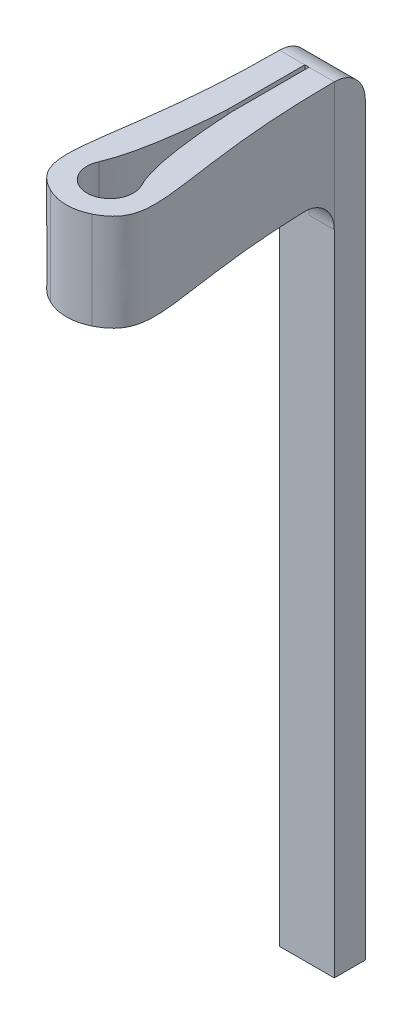
ISO-10303-21;
HEADER;
FILE_DESCRIPTION(('STEP AP214'),'2;1');
FILE_NAME('part.step','',(''),(''),'','','');
FILE_SCHEMA(('AUTOMOTIVE_DESIGN { 1 0 10303 214 1 1 1 1 }'));
ENDSEC;
DATA;
#1=APPLICATION_CONTEXT('core data for automotive mechanical design processes');
#2=APPLICATION_PROTOCOL_DEFINITION('international standard','automotive_design',2000,#1);
#3=PRODUCT_CONTEXT('',#1,'mechanical');
#4=PRODUCT('Part','Part','',(#3));
#5=PRODUCT_RELATED_PRODUCT_CATEGORY('part','',(#4));
#6=PRODUCT_DEFINITION_FORMATION('','',#4);
#7=PRODUCT_DEFINITION_CONTEXT('part definition',#1,'design');
#8=PRODUCT_DEFINITION('design','',#6,#7);
#9=PRODUCT_DEFINITION_SHAPE('','',#8);
#10=(LENGTH_UNIT() NAMED_UNIT(*) SI_UNIT(.MILLI.,.METRE.));
#11=(NAMED_UNIT(*) PLANE_ANGLE_UNIT() SI_UNIT($,.RADIAN.));
#12=(NAMED_UNIT(*) SI_UNIT($,.STERADIAN.) SOLID_ANGLE_UNIT());
#13=UNCERTAINTY_MEASURE_WITH_UNIT(LENGTH_MEASURE(1.E-05),#10,'distance_accuracy_value','');
#14=(GEOMETRIC_REPRESENTATION_CONTEXT(3) GLOBAL_UNCERTAINTY_ASSIGNED_CONTEXT((#13)) GLOBAL_UNIT_ASSIGNED_CONTEXT((#10,
#11,#12)) REPRESENTATION_CONTEXT('',''));
#15=CARTESIAN_POINT('',(0.,0.,0.));
#16=DIRECTION('',(0.,0.,1.));
#17=DIRECTION('',(1.,0.,0.));
#18=AXIS2_PLACEMENT_3D('',#15,#16,#17);
#19=CARTESIAN_POINT('',(0.895808533337032,-1.5875,-8.72399360067777));
#20=CARTESIAN_POINT('',(0.895808533337031,-1.5875,-4.54222595975247));
#21=CARTESIAN_POINT('',(1.58866877369205,-1.5875,-2.21931302735155));
#22=CARTESIAN_POINT('',(2.08819617284586,-1.5875,-1.33769603441971));
#23=CARTESIAN_POINT('',(0.,-1.5875,-0.766240153873851));
#24=B_SPLINE_CURVE_WITH_KNOTS('',4,(#19,#20,#21,#22,#23),.UNSPECIFIED.,.F.,.F.,(5,5),(0.,1.),.UNSPECIFIED.);
#25=DIRECTION('',(0.,1.,0.));
#26=VECTOR('',#25,1.);
#27=SURFACE_OF_LINEAR_EXTRUSION('',#24,#26);
#28=CARTESIAN_POINT('',(0.895808533337032,1.5875,-8.72399360067777));
#29=CARTESIAN_POINT('',(0.895808533337031,1.5875,-4.54222595975247));
#30=CARTESIAN_POINT('',(1.58866877369205,1.5875,-2.21931302735155));
#31=CARTESIAN_POINT('',(2.08819617284586,1.5875,-1.33769603441971));
#32=CARTESIAN_POINT('',(0.,1.5875,-0.766240153873851));
#33=B_SPLINE_CURVE_WITH_KNOTS('',4,(#28,#29,#30,#31,#32),.UNSPECIFIED.,.F.,.F.,(5,5),(0.,1.),.UNSPECIFIED.);
#34=CARTESIAN_POINT('',(0.895808533337032,1.5875,-8.72399360067777));
#35=VERTEX_POINT('',#34);
#36=CARTESIAN_POINT('',(0.681157625975045,1.5875,-1.01372499642951));
#37=VERTEX_POINT('',#36);
#38=EDGE_CURVE('E200',#35,#37,#33,.T.);
#39=ORIENTED_EDGE('',*,*,#38,.T.);
#40=DIRECTION('',(0.,1.,0.));
#41=VECTOR('',#40,1.);
#42=CARTESIAN_POINT('',(0.681157625975055,1.5875,-1.01372499642951));
#43=LINE('',#42,#41);
#44=CARTESIAN_POINT('',(0.681157625975045,-1.5875,-1.01372499642951));
#45=VERTEX_POINT('',#44);
#46=EDGE_CURVE('E335',#37,#45,#43,.F.);
#47=ORIENTED_EDGE('',*,*,#46,.T.);
#48=CARTESIAN_POINT('',(0.911587539087842,-1.5875,-7.70799360067432));
#49=VERTEX_POINT('',#48);
#50=EDGE_CURVE('E238',#49,#45,#24,.T.);
#51=ORIENTED_EDGE('',*,*,#50,.F.);
#52=CARTESIAN_POINT('',(0.911587539197454,-1.5875,-7.70799360067777));
#53=CARTESIAN_POINT('',(0.910687809800488,-1.58750020154353,-7.73656228207012));
#54=CARTESIAN_POINT('',(0.909828401695823,-1.58870574045511,-7.7651185656679));
#55=CARTESIAN_POINT('',(0.90819300425027,-1.5935157615637,-7.82202947828193));
#56=CARTESIAN_POINT('',(0.907417011268845,-1.59712013901737,-7.85038411604825));
#57=CARTESIAN_POINT('',(0.90522061742666,-1.61149830750074,-7.934791382646));
#58=CARTESIAN_POINT('',(0.903928824259647,-1.62583722506948,-7.99028250102405));
#59=CARTESIAN_POINT('',(0.901687780355163,-1.66362767079934,-8.09807597420566));
#60=CARTESIAN_POINT('',(0.900738699721182,-1.6870837122351,-8.1503767348191));
#61=CARTESIAN_POINT('',(0.899148918125929,-1.7424439920314,-8.25030140229158));
#62=CARTESIAN_POINT('',(0.898508161508523,-1.77434670405493,-8.29792615198959));
#63=CARTESIAN_POINT('',(0.897480241404394,-1.84568248092687,-8.38713458214714));
#64=CARTESIAN_POINT('',(0.897093041736971,-1.88511447036556,-8.42871912384035));
#65=CARTESIAN_POINT('',(0.896505635566173,-1.97042533950588,-8.50469331607981));
#66=CARTESIAN_POINT('',(0.896305426265007,-2.01630412273733,-8.53908307427001));
#67=CARTESIAN_POINT('',(0.896095275332461,-2.08893141968298,-8.58451809079835));
#68=CARTESIAN_POINT('',(0.896040243582188,-2.11379891917112,-8.5986478706947));
#69=CARTESIAN_POINT('',(0.895952741355683,-2.16461033576607,-8.62475273887168));
#70=CARTESIAN_POINT('',(0.895920250848357,-2.19055327540558,-8.63672973317594));
#71=CARTESIAN_POINT('',(0.895845880076851,-2.26975528018769,-8.66930535432631));
#72=CARTESIAN_POINT('',(0.895826986363067,-2.32443795537599,-8.68658010362134));
#73=CARTESIAN_POINT('',(0.89581162290249,-2.41678549274286,-8.7073988816611));
#74=CARTESIAN_POINT('',(0.895809696419543,-2.45387963513848,-8.71361781330608));
#75=CARTESIAN_POINT('',(0.895808522239813,-2.52847501112442,-8.72191351181843));
#76=CARTESIAN_POINT('',(0.895809270752433,-2.56597559364876,-8.72399613352736));
#77=CARTESIAN_POINT('',(0.895808533337032,-2.6035,-8.72399360067777));
#78=B_SPLINE_CURVE_WITH_KNOTS('',3,(#52,#53,#54,#55,#56,#57,#58,#59,#60,#61,#62,#63,#64,#65,#66,
#67,#68,#69,#70,#71,#72,#73,#74,#75,#76,#77),.UNSPECIFIED.,.F.,.F.,(4,2,2,2,2,2,2,2,2,2,2,2,4),
(0.,0.085695932904716,0.171388124211498,0.342490591302074,0.513677867809693,0.684834231385102,
0.855966166890245,1.02709554184067,1.1128111033343,1.19845039648162,1.36955284386112,
1.48218102751132,1.5946496748889),.UNSPECIFIED.);
#79=CARTESIAN_POINT('',(0.895808533337032,-2.6035,-8.72399360067777));
#80=VERTEX_POINT('',#79);
#81=EDGE_CURVE('E384',#49,#80,#78,.T.);
#82=ORIENTED_EDGE('',*,*,#81,.T.);
#83=DIRECTION('',(0.,1.,0.));
#84=VECTOR('',#83,1.);
#85=CARTESIAN_POINT('',(0.895808533337032,-1.5875,-8.72399360067777));
#86=LINE('',#85,#84);
#87=EDGE_CURVE('E74',#80,#35,#86,.T.);
#88=ORIENTED_EDGE('',*,*,#87,.T.);
#89=EDGE_LOOP('',(#39,#47,#51,#82,#88));
#90=FACE_BOUND('',#89,.T.);
#91=ADVANCED_FACE('F53',(#90),#27,.F.);
#92=CARTESIAN_POINT('',(-0.895808533337031,-1.5875,-8.72399360067777));
#93=CARTESIAN_POINT('',(-0.895808533337032,-1.5875,-4.54222595975247));
#94=CARTESIAN_POINT('',(-1.58866877369205,-1.5875,-2.21931302735155));
#95=CARTESIAN_POINT('',(-2.08819617284586,-1.5875,-1.33769603441971));
#96=CARTESIAN_POINT('',(0.,-1.5875,-0.766240153873851));
#97=B_SPLINE_CURVE_WITH_KNOTS('',4,(#92,#93,#94,#95,#96),.UNSPECIFIED.,.F.,.F.,(5,5),(0.,1.),.UNSPECIFIED.);
#98=DIRECTION('',(0.,1.,0.));
#99=VECTOR('',#98,1.);
#100=SURFACE_OF_LINEAR_EXTRUSION('',#97,#99);
#101=DIRECTION('',(0.,1.,0.));
#102=VECTOR('',#101,1.);
#103=CARTESIAN_POINT('',(-0.895808533337031,-1.5875,-8.72399360067777));
#104=LINE('',#103,#102);
#105=CARTESIAN_POINT('',(-0.895808533337031,-2.6035,-8.72399360067777));
#106=VERTEX_POINT('',#105);
#107=CARTESIAN_POINT('',(-0.895808533337031,1.5875,-8.72399360067777));
#108=VERTEX_POINT('',#107);
#109=EDGE_CURVE('E358',#106,#108,#104,.T.);
#110=ORIENTED_EDGE('',*,*,#109,.F.);
#111=CARTESIAN_POINT('',(-0.895808533337031,-2.6035,-8.72399360067777));
#112=CARTESIAN_POINT('',(-0.895808743106817,-2.57491535799627,-8.72399339704989));
#113=CARTESIAN_POINT('',(-0.895808509634764,-2.54634442105056,-8.72278651625416));
#114=CARTESIAN_POINT('',(-0.895808945285132,-2.48940695736893,-8.71797176093347));
#115=CARTESIAN_POINT('',(-0.895809614365375,-2.46104042114313,-8.71436399861163));
#116=CARTESIAN_POINT('',(-0.895815652000113,-2.37660177242559,-8.69997359110934));
#117=CARTESIAN_POINT('',(-0.895825039858982,-2.32109522362829,-8.68562373061271));
#118=CARTESIAN_POINT('',(-0.895889673653902,-2.21328087570048,-8.64780997418841));
#119=CARTESIAN_POINT('',(-0.89594494164699,-2.16097462811514,-8.6243416974372));
#120=CARTESIAN_POINT('',(-0.896155773215785,-2.06104521858159,-8.56895754704096));
#121=CARTESIAN_POINT('',(-0.896311319157401,-2.01342123494399,-8.53704315924411));
#122=CARTESIAN_POINT('',(-0.896788030806549,-1.92420994603243,-8.46567867701101));
#123=CARTESIAN_POINT('',(-0.897109205777026,-1.8826229785505,-8.42622816118802));
#124=CARTESIAN_POINT('',(-0.897985496509428,-1.80665054997545,-8.34088092880188));
#125=CARTESIAN_POINT('',(-0.898540608155707,-1.77226496220445,-8.29498432565415));
#126=CARTESIAN_POINT('',(-0.89959215524745,-1.72684541355829,-8.2223403101981));
#127=CARTESIAN_POINT('',(-0.899979514048294,-1.71272397612018,-8.19747289480117));
#128=CARTESIAN_POINT('',(-0.900832489130423,-1.68663588384435,-8.14666360711391));
#129=CARTESIAN_POINT('',(-0.901298035482609,-1.67466732316098,-8.12072271040671));
#130=CARTESIAN_POINT('',(-0.902820059558785,-1.64211669259691,-8.04153006333644));
#131=CARTESIAN_POINT('',(-0.904002617570672,-1.62485831588146,-7.98685810228082));
#132=CARTESIAN_POINT('',(-0.906250353415792,-1.6040665250385,-7.89455174723449));
#133=CARTESIAN_POINT('',(-0.907217357872269,-1.59785778058466,-7.85748517665549));
#134=CARTESIAN_POINT('',(-0.909295430573787,-1.58957618699796,-7.7829503339892));
#135=CARTESIAN_POINT('',(-0.910406291686676,-1.58749746025438,-7.74548270917203));
#136=CARTESIAN_POINT('',(-0.911587539087817,-1.5875,-7.7079936006751));
#137=B_SPLINE_CURVE_WITH_KNOTS('',3,(#111,#112,#113,#114,#115,#116,#117,#118,#119,#120,#121,
#122,#123,#124,#125,#126,#127,#128,#129,#130,#131,#132,#133,#134,#135,#136),.UNSPECIFIED.,.F.,
.F.,(4,2,2,2,2,2,2,2,2,2,2,2,4),(0.,0.0857012325238336,0.171398460155598,0.342510368805133,
0.513704587782642,0.684868710100984,0.856042405958368,1.02721309048409,1.11292375498184,
1.19855816617761,1.36965146485975,1.48223068651059,1.59464957660383),.UNSPECIFIED.);
#138=CARTESIAN_POINT('',(-0.911587539087841,-1.5875,-7.70799360067433));
#139=VERTEX_POINT('',#138);
#140=EDGE_CURVE('E13',#106,#139,#137,.T.);
#141=ORIENTED_EDGE('',*,*,#140,.T.);
#142=CARTESIAN_POINT('',(-0.681157625975042,-1.5875,-1.01372499642951));
#143=VERTEX_POINT('',#142);
#144=EDGE_CURVE('E261',#139,#143,#97,.T.);
#145=ORIENTED_EDGE('',*,*,#144,.T.);
#146=DIRECTION('',(0.,1.,0.));
#147=VECTOR('',#146,1.);
#148=CARTESIAN_POINT('',(-0.681157625975053,-1.5875,-1.01372499642951));
#149=LINE('',#148,#147);
#150=CARTESIAN_POINT('',(-0.681157625975042,1.5875,-1.01372499642951));
#151=VERTEX_POINT('',#150);
#152=EDGE_CURVE('E350',#143,#151,#149,.T.);
#153=ORIENTED_EDGE('',*,*,#152,.T.);
#154=CARTESIAN_POINT('',(-0.895808533337031,1.5875,-8.72399360067777));
#155=CARTESIAN_POINT('',(-0.895808533337032,1.5875,-4.54222595975247));
#156=CARTESIAN_POINT('',(-1.58866877369205,1.5875,-2.21931302735155));
#157=CARTESIAN_POINT('',(-2.08819617284586,1.5875,-1.33769603441971));
#158=CARTESIAN_POINT('',(0.,1.5875,-0.766240153873851));
#159=B_SPLINE_CURVE_WITH_KNOTS('',4,(#154,#155,#156,#157,#158),.UNSPECIFIED.,.F.,.F.,(5,5),(0.,
1.),.UNSPECIFIED.);
#160=EDGE_CURVE('E233',#108,#151,#159,.T.);
#161=ORIENTED_EDGE('',*,*,#160,.F.);
#162=EDGE_LOOP('',(#110,#141,#145,#153,#161));
#163=FACE_BOUND('',#162,.T.);
#164=ADVANCED_FACE('F279',(#163),#100,.T.);
#165=CARTESIAN_POINT('',(-0.0682967636124147,-1.5875,0.));
#166=DIRECTION('',(-1.,0.,0.));
#167=DIRECTION('',(0.,0.,1.));
#168=AXIS2_PLACEMENT_3D('',#165,#166,#167);
#169=PLANE('',#168);
#170=DIRECTION('',(0.,1.,0.));
#171=VECTOR('',#170,1.);
#172=CARTESIAN_POINT('',(-0.0682967636124158,-1.5875,-8.72399360067777));
#173=LINE('',#172,#171);
#174=CARTESIAN_POINT('',(-0.0682967636124158,-2.6035,-8.72399360067777));
#175=VERTEX_POINT('',#174);
#176=CARTESIAN_POINT('',(-0.0682967636124156,1.5875,-8.72399360067777));
#177=VERTEX_POINT('',#176);
#178=EDGE_CURVE('E273',#175,#177,#173,.T.);
#179=ORIENTED_EDGE('',*,*,#178,.T.);
#180=DIRECTION('',(0.,0.,1.));
#181=VECTOR('',#180,1.);
#182=CARTESIAN_POINT('',(-0.0682967636124147,1.5875,0.));
#183=LINE('',#182,#181);
#184=CARTESIAN_POINT('',(-0.0682967636124155,1.5875,-6.21461869480893));
#185=VERTEX_POINT('',#184);
#186=EDGE_CURVE('E227',#177,#185,#183,.T.);
#187=ORIENTED_EDGE('',*,*,#186,.T.);
#188=DIRECTION('',(0.,1.,0.));
#189=VECTOR('',#188,1.);
#190=CARTESIAN_POINT('',(-0.0682967636124155,-1.5875,-6.21461869480893));
#191=LINE('',#190,#189);
#192=CARTESIAN_POINT('',(-0.0682967636124155,-1.5875,-6.21461869480893));
#193=VERTEX_POINT('',#192);
#194=EDGE_CURVE('E411',#193,#185,#191,.T.);
#195=ORIENTED_EDGE('',*,*,#194,.F.);
#196=DIRECTION('',(0.,0.,1.));
#197=VECTOR('',#196,1.);
#198=CARTESIAN_POINT('',(-0.0682967636124147,-1.5875,0.));
#199=LINE('',#198,#197);
#200=CARTESIAN_POINT('',(-0.0682967636124157,-1.5875,-7.70799360067777));
#201=VERTEX_POINT('',#200);
#202=EDGE_CURVE('E264',#201,#193,#199,.T.);
#203=ORIENTED_EDGE('',*,*,#202,.F.);
#204=CARTESIAN_POINT('',(-0.0682967636124157,-2.6035,-7.70799360067777));
#205=DIRECTION('',(-1.,0.,0.));
#206=DIRECTION('',(0.,0.,1.));
#207=AXIS2_PLACEMENT_3D('',#204,#205,#206);
#208=CIRCLE('',#207,1.016);
#209=EDGE_CURVE('E67',#201,#175,#208,.T.);
#210=ORIENTED_EDGE('',*,*,#209,.T.);
#211=EDGE_LOOP('',(#179,#187,#195,#203,#210));
#212=FACE_BOUND('',#211,.T.);
#213=ADVANCED_FACE('F284',(#212),#169,.F.);
#214=CARTESIAN_POINT('',(-0.69080742229309,-1.5875,-2.60647548731597));
#215=CARTESIAN_POINT('',(-0.217222133422871,-1.5875,-3.73873423608694));
#216=CARTESIAN_POINT('',(-0.0682967636124155,-1.5875,-6.21461869480893));
#217=B_SPLINE_CURVE_WITH_KNOTS('',2,(#214,#215,#216),.UNSPECIFIED.,.F.,.F.,(3,3),(0.,1.),.UNSPECIFIED.);
#218=DIRECTION('',(0.,1.,0.));
#219=VECTOR('',#218,1.);
#220=SURFACE_OF_LINEAR_EXTRUSION('',#217,#219);
#221=ORIENTED_EDGE('',*,*,#194,.T.);
#222=CARTESIAN_POINT('',(-0.69080742229309,1.5875,-2.60647548731597));
#223=CARTESIAN_POINT('',(-0.217222133422871,1.5875,-3.73873423608694));
#224=CARTESIAN_POINT('',(-0.0682967636124155,1.5875,-6.21461869480893));
#225=B_SPLINE_CURVE_WITH_KNOTS('',2,(#222,#223,#224),.UNSPECIFIED.,.F.,.F.,(3,3),(0.,1.),.UNSPECIFIED.);
#226=CARTESIAN_POINT('',(-0.69080742229309,1.5875,-2.60647548731597));
#227=VERTEX_POINT('',#226);
#228=EDGE_CURVE('E222',#227,#185,#225,.T.);
#229=ORIENTED_EDGE('',*,*,#228,.F.);
#230=DIRECTION('',(0.,1.,0.));
#231=VECTOR('',#230,1.);
#232=CARTESIAN_POINT('',(-0.69080742229309,-1.5875,-2.60647548731597));
#233=LINE('',#232,#231);
#234=CARTESIAN_POINT('',(-0.69080742229309,-1.5875,-2.60647548731597));
#235=VERTEX_POINT('',#234);
#236=EDGE_CURVE('E410',#235,#227,#233,.T.);
#237=ORIENTED_EDGE('',*,*,#236,.F.);
#238=EDGE_CURVE('E297',#235,#193,#217,.T.);
#239=ORIENTED_EDGE('',*,*,#238,.T.);
#240=EDGE_LOOP('',(#221,#229,#237,#239));
#241=FACE_BOUND('',#240,.T.);
#242=ADVANCED_FACE('F290',(#241),#220,.T.);
#243=CARTESIAN_POINT('',(0.,-1.5875,-2.28487153008787));
#244=DIRECTION('',(0.,1.,0.));
#245=DIRECTION('',(0.,0.,1.));
#246=AXIS2_PLACEMENT_3D('',#243,#244,#245);
#247=CYLINDRICAL_SURFACE('',#246,0.762);
#248=ORIENTED_EDGE('',*,*,#236,.T.);
#249=CARTESIAN_POINT('',(0.,1.5875,-2.28487153008787));
#250=DIRECTION('',(0.,1.,0.));
#251=DIRECTION('',(0.,0.,1.));
#252=AXIS2_PLACEMENT_3D('',#249,#250,#251);
#253=CIRCLE('',#252,0.762);
#254=CARTESIAN_POINT('',(0.69080742229309,1.5875,-2.60647548731597));
#255=VERTEX_POINT('',#254);
#256=EDGE_CURVE('E216',#227,#255,#253,.T.);
#257=ORIENTED_EDGE('',*,*,#256,.T.);
#258=DIRECTION('',(0.,1.,0.));
#259=VECTOR('',#258,1.);
#260=CARTESIAN_POINT('',(0.69080742229309,-1.5875,-2.60647548731597));
#261=LINE('',#260,#259);
#262=CARTESIAN_POINT('',(0.69080742229309,-1.5875,-2.60647548731597));
#263=VERTEX_POINT('',#262);
#264=EDGE_CURVE('E408',#263,#255,#261,.T.);
#265=ORIENTED_EDGE('',*,*,#264,.F.);
#266=CARTESIAN_POINT('',(0.,-1.5875,-2.28487153008787));
#267=DIRECTION('',(0.,1.,0.));
#268=DIRECTION('',(0.,0.,1.));
#269=AXIS2_PLACEMENT_3D('',#266,#267,#268);
#270=CIRCLE('',#269,0.762);
#271=EDGE_CURVE('E303',#235,#263,#270,.T.);
#272=ORIENTED_EDGE('',*,*,#271,.F.);
#273=EDGE_LOOP('',(#248,#257,#265,#272));
#274=FACE_BOUND('',#273,.T.);
#275=ADVANCED_FACE('F294',(#274),#247,.F.);
#276=CARTESIAN_POINT('',(0.69080742229309,-1.5875,-2.60647548731597));
#277=CARTESIAN_POINT('',(0.218071276463601,-1.5875,-3.48213292446278));
#278=CARTESIAN_POINT('',(0.0682967636124155,-1.5875,-6.21461869480893));
#279=B_SPLINE_CURVE_WITH_KNOTS('',2,(#276,#277,#278),.UNSPECIFIED.,.F.,.F.,(3,3),(0.,1.),.UNSPECIFIED.);
#280=DIRECTION('',(0.,1.,0.));
#281=VECTOR('',#280,1.);
#282=SURFACE_OF_LINEAR_EXTRUSION('',#279,#281);
#283=ORIENTED_EDGE('',*,*,#264,.T.);
#284=CARTESIAN_POINT('',(0.69080742229309,1.5875,-2.60647548731597));
#285=CARTESIAN_POINT('',(0.218071276463601,1.5875,-3.48213292446278));
#286=CARTESIAN_POINT('',(0.0682967636124155,1.5875,-6.21461869480893));
#287=B_SPLINE_CURVE_WITH_KNOTS('',2,(#284,#285,#286),.UNSPECIFIED.,.F.,.F.,(3,3),(0.,1.),.UNSPECIFIED.);
#288=CARTESIAN_POINT('',(0.0682967636124155,1.5875,-6.21461869480893));
#289=VERTEX_POINT('',#288);
#290=EDGE_CURVE('E211',#255,#289,#287,.T.);
#291=ORIENTED_EDGE('',*,*,#290,.T.);
#292=DIRECTION('',(0.,1.,0.));
#293=VECTOR('',#292,1.);
#294=CARTESIAN_POINT('',(0.0682967636124155,-1.5875,-6.21461869480893));
#295=LINE('',#294,#293);
#296=CARTESIAN_POINT('',(0.0682967636124155,-1.5875,-6.21461869480893));
#297=VERTEX_POINT('',#296);
#298=EDGE_CURVE('E406',#297,#289,#295,.T.);
#299=ORIENTED_EDGE('',*,*,#298,.F.);
#300=EDGE_CURVE('E307',#263,#297,#279,.T.);
#301=ORIENTED_EDGE('',*,*,#300,.F.);
#302=EDGE_LOOP('',(#283,#291,#299,#301));
#303=FACE_BOUND('',#302,.T.);
#304=ADVANCED_FACE('F315',(#303),#282,.F.);
#305=CARTESIAN_POINT('',(0.0682967636124147,-1.5875,0.));
#306=DIRECTION('',(-1.,0.,0.));
#307=DIRECTION('',(0.,0.,1.));
#308=AXIS2_PLACEMENT_3D('',#305,#306,#307);
#309=PLANE('',#308);
#310=ORIENTED_EDGE('',*,*,#298,.T.);
#311=DIRECTION('',(0.,0.,1.));
#312=VECTOR('',#311,1.);
#313=CARTESIAN_POINT('',(0.0682967636124147,1.5875,0.));
#314=LINE('',#313,#312);
#315=CARTESIAN_POINT('',(0.0682967636124158,1.5875,-8.72399360067777));
#316=VERTEX_POINT('',#315);
#317=EDGE_CURVE('E205',#316,#289,#314,.T.);
#318=ORIENTED_EDGE('',*,*,#317,.F.);
#319=DIRECTION('',(0.,1.,0.));
#320=VECTOR('',#319,1.);
#321=CARTESIAN_POINT('',(0.0682967636124158,-1.5875,-8.72399360067777));
#322=LINE('',#321,#320);
#323=CARTESIAN_POINT('',(0.0682967636124158,-2.6035,-8.72399360067777));
#324=VERTEX_POINT('',#323);
#325=EDGE_CURVE('E355',#324,#316,#322,.T.);
#326=ORIENTED_EDGE('',*,*,#325,.F.);
#327=CARTESIAN_POINT('',(0.0682967636124157,-2.6035,-7.70799360067777));
#328=DIRECTION('',(-1.,0.,0.));
#329=DIRECTION('',(0.,0.,1.));
#330=AXIS2_PLACEMENT_3D('',#327,#328,#329);
#331=CIRCLE('',#330,1.016);
#332=CARTESIAN_POINT('',(0.0682967636124157,-1.5875,-7.70799360067777));
#333=VERTEX_POINT('',#332);
#334=EDGE_CURVE('E382',#324,#333,#331,.F.);
#335=ORIENTED_EDGE('',*,*,#334,.T.);
#336=DIRECTION('',(0.,0.,1.));
#337=VECTOR('',#336,1.);
#338=CARTESIAN_POINT('',(0.0682967636124147,-1.5875,0.));
#339=LINE('',#338,#337);
#340=EDGE_CURVE('E246',#333,#297,#339,.T.);
#341=ORIENTED_EDGE('',*,*,#340,.T.);
#342=EDGE_LOOP('',(#310,#318,#326,#335,#341));
#343=FACE_BOUND('',#342,.T.);
#344=ADVANCED_FACE('F317',(#343),#309,.T.);
#345=CARTESIAN_POINT('',(0.,-1.5875,0.));
#346=DIRECTION('',(0.,1.,0.));
#347=DIRECTION('',(0.,0.,1.));
#348=AXIS2_PLACEMENT_3D('',#345,#346,#347);
#349=PLANE('',#348);
#350=ORIENTED_EDGE('',*,*,#340,.F.);
#351=DIRECTION('',(-1.,0.,0.));
#352=VECTOR('',#351,1.);
#353=CARTESIAN_POINT('',(0.,-1.5875,-7.70799360067777));
#354=LINE('',#353,#352);
#355=EDGE_CURVE('E365',#333,#49,#354,.F.);
#356=ORIENTED_EDGE('',*,*,#355,.T.);
#357=ORIENTED_EDGE('',*,*,#50,.T.);
#358=CARTESIAN_POINT('',(0.,-1.5875,-2.37702991044399));
#359=DIRECTION('',(0.,1.,0.));
#360=DIRECTION('',(0.,0.,1.));
#361=AXIS2_PLACEMENT_3D('',#358,#359,#360);
#362=CIRCLE('',#361,1.524);
#363=EDGE_CURVE('E347',#45,#143,#362,.F.);
#364=ORIENTED_EDGE('',*,*,#363,.T.);
#365=ORIENTED_EDGE('',*,*,#144,.F.);
#366=DIRECTION('',(1.,0.,0.));
#367=VECTOR('',#366,1.);
#368=CARTESIAN_POINT('',(0.,-1.5875,-7.70799360067777));
#369=LINE('',#368,#367);
#370=EDGE_CURVE('E265',#139,#201,#369,.T.);
#371=ORIENTED_EDGE('',*,*,#370,.T.);
#372=ORIENTED_EDGE('',*,*,#202,.T.);
#373=ORIENTED_EDGE('',*,*,#238,.F.);
#374=ORIENTED_EDGE('',*,*,#271,.T.);
#375=ORIENTED_EDGE('',*,*,#300,.T.);
#376=EDGE_LOOP('',(#350,#356,#357,#364,#365,#371,#372,#373,#374,#375));
#377=FACE_BOUND('',#376,.T.);
#378=ADVANCED_FACE('F286',(#377),#349,.F.);
#379=CARTESIAN_POINT('',(0.,1.5875,0.));
#380=DIRECTION('',(0.,1.,0.));
#381=DIRECTION('',(0.,0.,1.));
#382=AXIS2_PLACEMENT_3D('',#379,#380,#381);
#383=PLANE('',#382);
#384=ORIENTED_EDGE('',*,*,#38,.F.);
#385=DIRECTION('',(-1.,0.,0.));
#386=VECTOR('',#385,1.);
#387=CARTESIAN_POINT('',(0.,1.5875,-8.72399360067777));
#388=LINE('',#387,#386);
#389=EDGE_CURVE('E372',#35,#316,#388,.T.);
#390=ORIENTED_EDGE('',*,*,#389,.T.);
#391=ORIENTED_EDGE('',*,*,#317,.T.);
#392=ORIENTED_EDGE('',*,*,#290,.F.);
#393=ORIENTED_EDGE('',*,*,#256,.F.);
#394=ORIENTED_EDGE('',*,*,#228,.T.);
#395=ORIENTED_EDGE('',*,*,#186,.F.);
#396=DIRECTION('',(-1.,0.,0.));
#397=VECTOR('',#396,1.);
#398=CARTESIAN_POINT('',(0.,1.5875,-8.72399360067777));
#399=LINE('',#398,#397);
#400=EDGE_CURVE('E369',#177,#108,#399,.T.);
#401=ORIENTED_EDGE('',*,*,#400,.T.);
#402=ORIENTED_EDGE('',*,*,#160,.T.);
#403=CARTESIAN_POINT('',(0.,1.5875,-2.37702991044399));
#404=DIRECTION('',(0.,1.,0.));
#405=DIRECTION('',(0.,0.,1.));
#406=AXIS2_PLACEMENT_3D('',#403,#404,#405);
#407=CIRCLE('',#406,1.524);
#408=EDGE_CURVE('E344',#151,#37,#407,.T.);
#409=ORIENTED_EDGE('',*,*,#408,.T.);
#410=EDGE_LOOP('',(#384,#390,#391,#392,#393,#394,#395,#401,#402,#409));
#411=FACE_BOUND('',#410,.T.);
#412=ADVANCED_FACE('F324',(#411),#383,.T.);
#413=CARTESIAN_POINT('',(0.,0.,-2.37702991044399));
#414=DIRECTION('',(0.,1.,0.));
#415=DIRECTION('',(0.,0.,1.));
#416=AXIS2_PLACEMENT_3D('',#413,#414,#415);
#417=CYLINDRICAL_SURFACE('',#416,1.524);
#418=ORIENTED_EDGE('',*,*,#363,.F.);
#419=ORIENTED_EDGE('',*,*,#46,.F.);
#420=ORIENTED_EDGE('',*,*,#408,.F.);
#421=ORIENTED_EDGE('',*,*,#152,.F.);
#422=EDGE_LOOP('',(#418,#419,#420,#421));
#423=FACE_BOUND('',#422,.T.);
#424=ADVANCED_FACE('F342',(#423),#417,.T.);
#425=CARTESIAN_POINT('',(0.895808533337032,0.,-8.72399360067777));
#426=DIRECTION('',(0.,0.,1.));
#427=DIRECTION('',(1.,0.,0.));
#428=AXIS2_PLACEMENT_3D('',#425,#426,#427);
#429=PLANE('',#428);
#430=DIRECTION('',(0.,1.,0.));
#431=VECTOR('',#430,1.);
#432=CARTESIAN_POINT('',(0.895808533337032,0.,-8.72399360067777));
#433=LINE('',#432,#431);
#434=CARTESIAN_POINT('',(0.895808533337032,-23.8125,-8.72399360067777));
#435=VERTEX_POINT('',#434);
#436=EDGE_CURVE('E188',#435,#80,#433,.T.);
#437=ORIENTED_EDGE('',*,*,#436,.T.);
#438=DIRECTION('',(-1.,0.,0.));
#439=VECTOR('',#438,1.);
#440=CARTESIAN_POINT('',(0.895808533337032,-2.6035,-8.72399360067777));
#441=LINE('',#440,#439);
#442=EDGE_CURVE('E259',#80,#324,#441,.T.);
#443=ORIENTED_EDGE('',*,*,#442,.T.);
#444=ORIENTED_EDGE('',*,*,#325,.T.);
#445=DIRECTION('',(-1.,0.,0.));
#446=VECTOR('',#445,1.);
#447=CARTESIAN_POINT('',(0.895808533337032,1.5875,-8.72399360067777));
#448=LINE('',#447,#446);
#449=EDGE_CURVE('E169',#316,#177,#448,.T.);
#450=ORIENTED_EDGE('',*,*,#449,.T.);
#451=ORIENTED_EDGE('',*,*,#178,.F.);
#452=DIRECTION('',(1.,0.,0.));
#453=VECTOR('',#452,1.);
#454=CARTESIAN_POINT('',(0.895808533337032,-2.6035,-8.72399360067777));
#455=LINE('',#454,#453);
#456=EDGE_CURVE('E177',#175,#106,#455,.F.);
#457=ORIENTED_EDGE('',*,*,#456,.T.);
#458=DIRECTION('',(0.,1.,0.));
#459=VECTOR('',#458,1.);
#460=CARTESIAN_POINT('',(-0.895808533337031,0.,-8.72399360067777));
#461=LINE('',#460,#459);
#462=CARTESIAN_POINT('',(-0.895808533337031,-23.8125,-8.72399360067777));
#463=VERTEX_POINT('',#462);
#464=EDGE_CURVE('E174',#463,#106,#461,.T.);
#465=ORIENTED_EDGE('',*,*,#464,.F.);
#466=DIRECTION('',(-1.,0.,0.));
#467=VECTOR('',#466,1.);
#468=CARTESIAN_POINT('',(0.895808533337032,-23.8125,-8.72399360067777));
#469=LINE('',#468,#467);
#470=EDGE_CURVE('E160',#435,#463,#469,.T.);
#471=ORIENTED_EDGE('',*,*,#470,.F.);
#472=EDGE_LOOP('',(#437,#443,#444,#450,#451,#457,#465,#471));
#473=FACE_BOUND('',#472,.T.);
#474=ADVANCED_FACE('F175',(#473),#429,.T.);
#475=CARTESIAN_POINT('',(0.895808533337032,0.,-9.73999360067777));
#476=DIRECTION('',(0.,0.,-1.));
#477=DIRECTION('',(0.,1.,0.));
#478=AXIS2_PLACEMENT_3D('',#475,#476,#477);
#479=PLANE('',#478);
#480=DIRECTION('',(0.,-1.,0.));
#481=VECTOR('',#480,1.);
#482=CARTESIAN_POINT('',(-0.895808533337031,0.,-9.73999360067777));
#483=LINE('',#482,#481);
#484=CARTESIAN_POINT('',(-0.895808533337031,0.5715,-9.73999360067777));
#485=VERTEX_POINT('',#484);
#486=CARTESIAN_POINT('',(-0.895808533337031,-23.8125,-9.73999360067777));
#487=VERTEX_POINT('',#486);
#488=EDGE_CURVE('E181',#485,#487,#483,.T.);
#489=ORIENTED_EDGE('',*,*,#488,.F.);
#490=DIRECTION('',(-1.,0.,0.));
#491=VECTOR('',#490,1.);
#492=CARTESIAN_POINT('',(0.895808533337032,0.5715,-9.73999360067777));
#493=LINE('',#492,#491);
#494=CARTESIAN_POINT('',(0.895808533337032,0.5715,-9.73999360067777));
#495=VERTEX_POINT('',#494);
#496=EDGE_CURVE('E378',#485,#495,#493,.F.);
#497=ORIENTED_EDGE('',*,*,#496,.T.);
#498=DIRECTION('',(0.,-1.,0.));
#499=VECTOR('',#498,1.);
#500=CARTESIAN_POINT('',(0.895808533337032,0.,-9.73999360067777));
#501=LINE('',#500,#499);
#502=CARTESIAN_POINT('',(0.895808533337032,-23.8125,-9.73999360067777));
#503=VERTEX_POINT('',#502);
#504=EDGE_CURVE('E186',#495,#503,#501,.T.);
#505=ORIENTED_EDGE('',*,*,#504,.T.);
#506=DIRECTION('',(-1.,0.,0.));
#507=VECTOR('',#506,1.);
#508=CARTESIAN_POINT('',(0.895808533337032,-23.8125,-9.73999360067777));
#509=LINE('',#508,#507);
#510=EDGE_CURVE('E170',#503,#487,#509,.T.);
#511=ORIENTED_EDGE('',*,*,#510,.T.);
#512=EDGE_LOOP('',(#489,#497,#505,#511));
#513=FACE_BOUND('',#512,.T.);
#514=ADVANCED_FACE('F423',(#513),#479,.T.);
#515=CARTESIAN_POINT('',(0.895808533337032,-23.8125,0.));
#516=DIRECTION('',(0.,1.,0.));
#517=DIRECTION('',(0.,0.,1.));
#518=AXIS2_PLACEMENT_3D('',#515,#516,#517);
#519=PLANE('',#518);
#520=ORIENTED_EDGE('',*,*,#470,.T.);
#521=DIRECTION('',(0.,0.,-1.));
#522=VECTOR('',#521,1.);
#523=CARTESIAN_POINT('',(-0.895808533337031,-23.8125,0.));
#524=LINE('',#523,#522);
#525=EDGE_CURVE('E165',#463,#487,#524,.T.);
#526=ORIENTED_EDGE('',*,*,#525,.T.);
#527=ORIENTED_EDGE('',*,*,#510,.F.);
#528=DIRECTION('',(0.,0.,-1.));
#529=VECTOR('',#528,1.);
#530=CARTESIAN_POINT('',(0.895808533337032,-23.8125,0.));
#531=LINE('',#530,#529);
#532=EDGE_CURVE('E167',#435,#503,#531,.T.);
#533=ORIENTED_EDGE('',*,*,#532,.F.);
#534=EDGE_LOOP('',(#520,#526,#527,#533));
#535=FACE_BOUND('',#534,.T.);
#536=ADVANCED_FACE('F162',(#535),#519,.F.);
#537=CARTESIAN_POINT('',(0.895808533337032,0.,0.));
#538=DIRECTION('',(1.,0.,0.));
#539=DIRECTION('',(0.,0.,-1.));
#540=AXIS2_PLACEMENT_3D('',#537,#538,#539);
#541=PLANE('',#540);
#542=ORIENTED_EDGE('',*,*,#504,.F.);
#543=CARTESIAN_POINT('',(0.895808533337032,0.5715,-8.72399360067777));
#544=DIRECTION('',(1.,0.,0.));
#545=DIRECTION('',(0.,0.,-1.));
#546=AXIS2_PLACEMENT_3D('',#543,#544,#545);
#547=CIRCLE('',#546,1.016);
#548=EDGE_CURVE('E380',#495,#35,#547,.T.);
#549=ORIENTED_EDGE('',*,*,#548,.T.);
#550=ORIENTED_EDGE('',*,*,#87,.F.);
#551=ORIENTED_EDGE('',*,*,#436,.F.);
#552=ORIENTED_EDGE('',*,*,#532,.T.);
#553=EDGE_LOOP('',(#542,#549,#550,#551,#552));
#554=FACE_BOUND('',#553,.T.);
#555=ADVANCED_FACE('F425',(#554),#541,.T.);
#556=CARTESIAN_POINT('',(-0.895808533337031,0.,0.));
#557=DIRECTION('',(1.,0.,0.));
#558=DIRECTION('',(0.,0.,-1.));
#559=AXIS2_PLACEMENT_3D('',#556,#557,#558);
#560=PLANE('',#559);
#561=ORIENTED_EDGE('',*,*,#109,.T.);
#562=CARTESIAN_POINT('',(-0.895808533337031,0.5715,-8.72399360067777));
#563=DIRECTION('',(1.,0.,0.));
#564=DIRECTION('',(0.,0.,-1.));
#565=AXIS2_PLACEMENT_3D('',#562,#563,#564);
#566=CIRCLE('',#565,1.016);
#567=EDGE_CURVE('E376',#108,#485,#566,.F.);
#568=ORIENTED_EDGE('',*,*,#567,.T.);
#569=ORIENTED_EDGE('',*,*,#488,.T.);
#570=ORIENTED_EDGE('',*,*,#525,.F.);
#571=ORIENTED_EDGE('',*,*,#464,.T.);
#572=EDGE_LOOP('',(#561,#568,#569,#570,#571));
#573=FACE_BOUND('',#572,.T.);
#574=ADVANCED_FACE('F183',(#573),#560,.F.);
#575=CARTESIAN_POINT('',(0.895808533337032,-2.6035,-7.70799360067777));
#576=DIRECTION('',(-1.,0.,0.));
#577=DIRECTION('',(0.,0.,1.));
#578=AXIS2_PLACEMENT_3D('',#575,#576,#577);
#579=CYLINDRICAL_SURFACE('',#578,1.016);
#580=ORIENTED_EDGE('',*,*,#81,.F.);
#581=ORIENTED_EDGE('',*,*,#355,.F.);
#582=ORIENTED_EDGE('',*,*,#334,.F.);
#583=ORIENTED_EDGE('',*,*,#442,.F.);
#584=EDGE_LOOP('',(#580,#581,#582,#583));
#585=FACE_BOUND('',#584,.T.);
#586=ADVANCED_FACE('F390',(#585),#579,.F.);
#587=CARTESIAN_POINT('',(0.,-2.6035,-7.70799360067777));
#588=DIRECTION('',(1.,0.,0.));
#589=DIRECTION('',(0.,0.,-1.));
#590=AXIS2_PLACEMENT_3D('',#587,#588,#589);
#591=CYLINDRICAL_SURFACE('',#590,1.016);
#592=ORIENTED_EDGE('',*,*,#140,.F.);
#593=ORIENTED_EDGE('',*,*,#456,.F.);
#594=ORIENTED_EDGE('',*,*,#209,.F.);
#595=ORIENTED_EDGE('',*,*,#370,.F.);
#596=EDGE_LOOP('',(#592,#593,#594,#595));
#597=FACE_BOUND('',#596,.T.);
#598=ADVANCED_FACE('F393',(#597),#591,.F.);
#599=CARTESIAN_POINT('',(0.,0.5715,-8.72399360067777));
#600=DIRECTION('',(-1.,0.,0.));
#601=DIRECTION('',(0.,0.,1.));
#602=AXIS2_PLACEMENT_3D('',#599,#600,#601);
#603=CYLINDRICAL_SURFACE('',#602,1.016);
#604=ORIENTED_EDGE('',*,*,#548,.F.);
#605=ORIENTED_EDGE('',*,*,#496,.F.);
#606=ORIENTED_EDGE('',*,*,#567,.F.);
#607=ORIENTED_EDGE('',*,*,#400,.F.);
#608=ORIENTED_EDGE('',*,*,#449,.F.);
#609=ORIENTED_EDGE('',*,*,#389,.F.);
#610=EDGE_LOOP('',(#604,#605,#606,#607,#608,#609));
#611=FACE_BOUND('',#610,.T.);
#612=ADVANCED_FACE('F55',(#611),#603,.T.);
#613=CLOSED_SHELL('',(#91,#164,#213,#242,#275,#304,#344,#378,#412,#424,#474,#514,#536,#555,#574,
#586,#598,#612));
#614=MANIFOLD_SOLID_BREP('B2',#613);
#615=ADVANCED_BREP_SHAPE_REPRESENTATION('',(#18,#614),#14);
#616=SHAPE_DEFINITION_REPRESENTATION(#9,#615);
ENDSEC;
END-ISO-10303-21;
